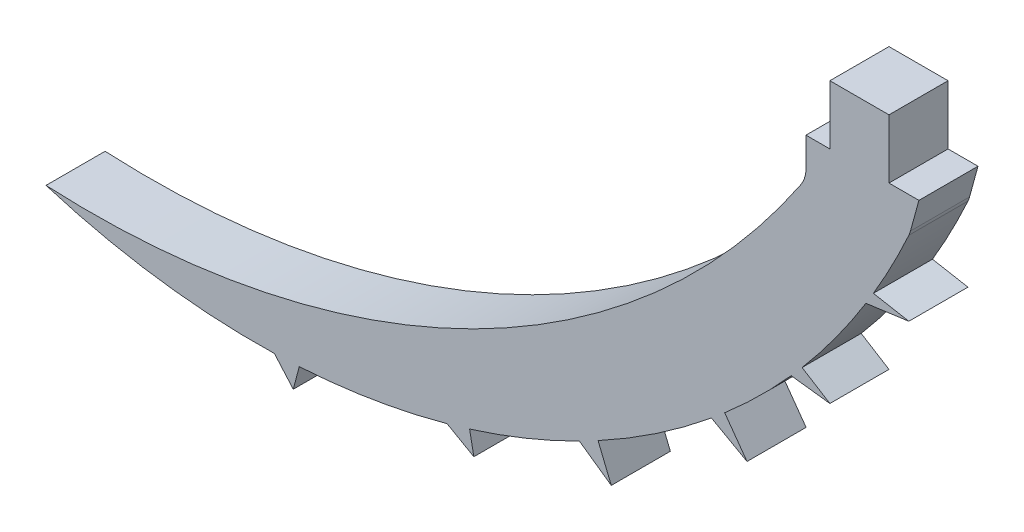
ISO-10303-21;
HEADER;
FILE_DESCRIPTION(('STEP AP214'),'2;1');
FILE_NAME('part.step','',(''),(''),'','','');
FILE_SCHEMA(('AUTOMOTIVE_DESIGN { 1 0 10303 214 1 1 1 1 }'));
ENDSEC;
DATA;
#1=APPLICATION_CONTEXT('core data for automotive mechanical design processes');
#2=APPLICATION_PROTOCOL_DEFINITION('international standard','automotive_design',2000,#1);
#3=PRODUCT_CONTEXT('',#1,'mechanical');
#4=PRODUCT('Part','Part','',(#3));
#5=PRODUCT_RELATED_PRODUCT_CATEGORY('part','',(#4));
#6=PRODUCT_DEFINITION_FORMATION('','',#4);
#7=PRODUCT_DEFINITION_CONTEXT('part definition',#1,'design');
#8=PRODUCT_DEFINITION('design','',#6,#7);
#9=PRODUCT_DEFINITION_SHAPE('','',#8);
#10=(LENGTH_UNIT() NAMED_UNIT(*) SI_UNIT(.MILLI.,.METRE.));
#11=(NAMED_UNIT(*) PLANE_ANGLE_UNIT() SI_UNIT($,.RADIAN.));
#12=(NAMED_UNIT(*) SI_UNIT($,.STERADIAN.) SOLID_ANGLE_UNIT());
#13=UNCERTAINTY_MEASURE_WITH_UNIT(LENGTH_MEASURE(1.E-05),#10,'distance_accuracy_value','');
#14=(GEOMETRIC_REPRESENTATION_CONTEXT(3) GLOBAL_UNCERTAINTY_ASSIGNED_CONTEXT((#13)) GLOBAL_UNIT_ASSIGNED_CONTEXT((#10,
#11,#12)) REPRESENTATION_CONTEXT('',''));
#15=CARTESIAN_POINT('',(0.,0.,0.));
#16=DIRECTION('',(0.,0.,1.));
#17=DIRECTION('',(1.,0.,0.));
#18=AXIS2_PLACEMENT_3D('',#15,#16,#17);
#19=CARTESIAN_POINT('',(-4.33765289990568,0.,1.524));
#20=DIRECTION('',(0.,-1.,0.));
#21=DIRECTION('',(1.,0.,0.));
#22=AXIS2_PLACEMENT_3D('',#19,#20,#21);
#23=PLANE('',#22);
#24=DIRECTION('',(-1.,0.,0.));
#25=VECTOR('',#24,1.);
#26=CARTESIAN_POINT('',(-4.33765289990568,0.,0.));
#27=LINE('',#26,#25);
#28=CARTESIAN_POINT('',(-3.56575185502095,0.,0.));
#29=VERTEX_POINT('',#28);
#30=CARTESIAN_POINT('',(-4.33765289990568,0.,0.));
#31=VERTEX_POINT('',#30);
#32=EDGE_CURVE('E254',#29,#31,#27,.T.);
#33=ORIENTED_EDGE('',*,*,#32,.T.);
#34=DIRECTION('',(0.,0.,-1.));
#35=VECTOR('',#34,1.);
#36=CARTESIAN_POINT('',(-4.33765289990568,0.,1.524));
#37=LINE('',#36,#35);
#38=CARTESIAN_POINT('',(-4.33765289990568,0.,1.524));
#39=VERTEX_POINT('',#38);
#40=EDGE_CURVE('E11',#39,#31,#37,.T.);
#41=ORIENTED_EDGE('',*,*,#40,.F.);
#42=DIRECTION('',(-1.,0.,0.));
#43=VECTOR('',#42,1.);
#44=CARTESIAN_POINT('',(-4.33765289990568,0.,1.524));
#45=LINE('',#44,#43);
#46=CARTESIAN_POINT('',(-3.56575185502095,0.,1.524));
#47=VERTEX_POINT('',#46);
#48=EDGE_CURVE('E310',#47,#39,#45,.T.);
#49=ORIENTED_EDGE('',*,*,#48,.F.);
#50=DIRECTION('',(0.,0.,-1.));
#51=VECTOR('',#50,1.);
#52=CARTESIAN_POINT('',(-3.56575185502095,0.,1.524));
#53=LINE('',#52,#51);
#54=EDGE_CURVE('E250',#47,#29,#53,.T.);
#55=ORIENTED_EDGE('',*,*,#54,.T.);
#56=EDGE_LOOP('',(#33,#41,#49,#55));
#57=FACE_BOUND('',#56,.T.);
#58=ADVANCED_FACE('F32',(#57),#23,.F.);
#59=CARTESIAN_POINT('',(-4.33765289990568,0.,1.524));
#60=DIRECTION('',(-1.,0.,0.));
#61=DIRECTION('',(0.,-1.,0.));
#62=AXIS2_PLACEMENT_3D('',#59,#60,#61);
#63=PLANE('',#62);
#64=DIRECTION('',(0.,1.,0.));
#65=VECTOR('',#64,1.);
#66=CARTESIAN_POINT('',(-4.33765289990568,0.,0.));
#67=LINE('',#66,#65);
#68=CARTESIAN_POINT('',(-4.33765289990569,1.52399999999999,0.));
#69=VERTEX_POINT('',#68);
#70=EDGE_CURVE('E257',#31,#69,#67,.T.);
#71=ORIENTED_EDGE('',*,*,#70,.T.);
#72=DIRECTION('',(0.,0.,-1.));
#73=VECTOR('',#72,1.);
#74=CARTESIAN_POINT('',(-4.33765289990569,1.52399999999999,1.524));
#75=LINE('',#74,#73);
#76=CARTESIAN_POINT('',(-4.33765289990569,1.52399999999999,1.524));
#77=VERTEX_POINT('',#76);
#78=EDGE_CURVE('E40',#77,#69,#75,.T.);
#79=ORIENTED_EDGE('',*,*,#78,.F.);
#80=DIRECTION('',(0.,1.,0.));
#81=VECTOR('',#80,1.);
#82=CARTESIAN_POINT('',(-4.33765289990568,0.,1.524));
#83=LINE('',#82,#81);
#84=EDGE_CURVE('E154',#39,#77,#83,.T.);
#85=ORIENTED_EDGE('',*,*,#84,.F.);
#86=ORIENTED_EDGE('',*,*,#40,.T.);
#87=EDGE_LOOP('',(#71,#79,#85,#86));
#88=FACE_BOUND('',#87,.T.);
#89=ADVANCED_FACE('F473',(#88),#63,.F.);
#90=CARTESIAN_POINT('',(-4.33765289990569,1.52399999999999,1.524));
#91=DIRECTION('',(0.,-1.,0.));
#92=DIRECTION('',(1.,0.,0.));
#93=AXIS2_PLACEMENT_3D('',#90,#91,#92);
#94=PLANE('',#93);
#95=DIRECTION('',(-1.,0.,0.));
#96=VECTOR('',#95,1.);
#97=CARTESIAN_POINT('',(-4.33765289990569,1.52399999999999,0.));
#98=LINE('',#97,#96);
#99=CARTESIAN_POINT('',(-5.86165289990569,1.52399999999999,0.));
#100=VERTEX_POINT('',#99);
#101=EDGE_CURVE('E259',#69,#100,#98,.T.);
#102=ORIENTED_EDGE('',*,*,#101,.T.);
#103=DIRECTION('',(0.,0.,-1.));
#104=VECTOR('',#103,1.);
#105=CARTESIAN_POINT('',(-5.86165289990569,1.52399999999999,1.524));
#106=LINE('',#105,#104);
#107=CARTESIAN_POINT('',(-5.86165289990569,1.52399999999999,1.524));
#108=VERTEX_POINT('',#107);
#109=EDGE_CURVE('E380',#108,#100,#106,.T.);
#110=ORIENTED_EDGE('',*,*,#109,.F.);
#111=DIRECTION('',(-1.,0.,0.));
#112=VECTOR('',#111,1.);
#113=CARTESIAN_POINT('',(-4.33765289990569,1.52399999999999,1.524));
#114=LINE('',#113,#112);
#115=EDGE_CURVE('E388',#77,#108,#114,.T.);
#116=ORIENTED_EDGE('',*,*,#115,.F.);
#117=ORIENTED_EDGE('',*,*,#78,.T.);
#118=EDGE_LOOP('',(#102,#110,#116,#117));
#119=FACE_BOUND('',#118,.T.);
#120=ADVANCED_FACE('F386',(#119),#94,.F.);
#121=CARTESIAN_POINT('',(-5.86165289990569,1.52399999999999,1.524));
#122=DIRECTION('',(1.,0.,0.));
#123=DIRECTION('',(0.,0.,-1.));
#124=AXIS2_PLACEMENT_3D('',#121,#122,#123);
#125=PLANE('',#124);
#126=DIRECTION('',(0.,-1.,0.));
#127=VECTOR('',#126,1.);
#128=CARTESIAN_POINT('',(-5.86165289990569,1.52399999999999,0.));
#129=LINE('',#128,#127);
#130=CARTESIAN_POINT('',(-5.86165289990569,0.,0.));
#131=VERTEX_POINT('',#130);
#132=EDGE_CURVE('E261',#100,#131,#129,.T.);
#133=ORIENTED_EDGE('',*,*,#132,.T.);
#134=DIRECTION('',(0.,0.,-1.));
#135=VECTOR('',#134,1.);
#136=CARTESIAN_POINT('',(-5.86165289990569,0.,1.524));
#137=LINE('',#136,#135);
#138=CARTESIAN_POINT('',(-5.86165289990569,0.,1.524));
#139=VERTEX_POINT('',#138);
#140=EDGE_CURVE('E377',#139,#131,#137,.T.);
#141=ORIENTED_EDGE('',*,*,#140,.F.);
#142=DIRECTION('',(0.,-1.,0.));
#143=VECTOR('',#142,1.);
#144=CARTESIAN_POINT('',(-5.86165289990569,1.52399999999999,1.524));
#145=LINE('',#144,#143);
#146=EDGE_CURVE('E406',#108,#139,#145,.T.);
#147=ORIENTED_EDGE('',*,*,#146,.F.);
#148=ORIENTED_EDGE('',*,*,#109,.T.);
#149=EDGE_LOOP('',(#133,#141,#147,#148));
#150=FACE_BOUND('',#149,.T.);
#151=ADVANCED_FACE('F397',(#150),#125,.F.);
#152=CARTESIAN_POINT('',(-5.86165289990569,0.,1.524));
#153=DIRECTION('',(0.,-1.,0.));
#154=DIRECTION('',(1.,0.,0.));
#155=AXIS2_PLACEMENT_3D('',#152,#153,#154);
#156=PLANE('',#155);
#157=DIRECTION('',(-1.,0.,0.));
#158=VECTOR('',#157,1.);
#159=CARTESIAN_POINT('',(-5.86165289990569,0.,0.));
#160=LINE('',#159,#158);
#161=CARTESIAN_POINT('',(-6.47829093911412,0.,0.));
#162=VERTEX_POINT('',#161);
#163=EDGE_CURVE('E263',#131,#162,#160,.T.);
#164=ORIENTED_EDGE('',*,*,#163,.T.);
#165=DIRECTION('',(0.,0.,-1.));
#166=VECTOR('',#165,1.);
#167=CARTESIAN_POINT('',(-6.47829093911412,0.,1.524));
#168=LINE('',#167,#166);
#169=CARTESIAN_POINT('',(-6.47829093911412,0.,1.524));
#170=VERTEX_POINT('',#169);
#171=EDGE_CURVE('E374',#170,#162,#168,.T.);
#172=ORIENTED_EDGE('',*,*,#171,.F.);
#173=DIRECTION('',(-1.,0.,0.));
#174=VECTOR('',#173,1.);
#175=CARTESIAN_POINT('',(-5.86165289990569,0.,1.524));
#176=LINE('',#175,#174);
#177=EDGE_CURVE('E403',#139,#170,#176,.T.);
#178=ORIENTED_EDGE('',*,*,#177,.F.);
#179=ORIENTED_EDGE('',*,*,#140,.T.);
#180=EDGE_LOOP('',(#164,#172,#178,#179));
#181=FACE_BOUND('',#180,.T.);
#182=ADVANCED_FACE('F401',(#181),#156,.F.);
#183=CARTESIAN_POINT('',(-6.47829093911412,0.,1.524));
#184=DIRECTION('',(1.,0.,0.));
#185=DIRECTION('',(0.,0.,-1.));
#186=AXIS2_PLACEMENT_3D('',#183,#184,#185);
#187=PLANE('',#186);
#188=DIRECTION('',(0.,-1.,0.));
#189=VECTOR('',#188,1.);
#190=CARTESIAN_POINT('',(-6.47829093911412,0.,0.));
#191=LINE('',#190,#189);
#192=CARTESIAN_POINT('',(-6.47829093911412,-0.743115039398693,0.));
#193=VERTEX_POINT('',#192);
#194=EDGE_CURVE('E265',#162,#193,#191,.T.);
#195=ORIENTED_EDGE('',*,*,#194,.T.);
#196=DIRECTION('',(0.,0.,-1.));
#197=VECTOR('',#196,1.);
#198=CARTESIAN_POINT('',(-6.47829093911412,-0.743115039398693,1.524));
#199=LINE('',#198,#197);
#200=CARTESIAN_POINT('',(-6.47829093911412,-0.743115039398693,1.524));
#201=VERTEX_POINT('',#200);
#202=EDGE_CURVE('E371',#201,#193,#199,.T.);
#203=ORIENTED_EDGE('',*,*,#202,.F.);
#204=DIRECTION('',(0.,-1.,0.));
#205=VECTOR('',#204,1.);
#206=CARTESIAN_POINT('',(-6.47829093911412,0.,1.524));
#207=LINE('',#206,#205);
#208=EDGE_CURVE('E405',#170,#201,#207,.T.);
#209=ORIENTED_EDGE('',*,*,#208,.F.);
#210=ORIENTED_EDGE('',*,*,#171,.T.);
#211=EDGE_LOOP('',(#195,#203,#209,#210));
#212=FACE_BOUND('',#211,.T.);
#213=ADVANCED_FACE('F486',(#212),#187,.F.);
#214=CARTESIAN_POINT('',(-7.24029093911412,-0.743115039398693,1.524));
#215=DIRECTION('',(0.,0.,-1.));
#216=DIRECTION('',(-1.,0.,0.));
#217=AXIS2_PLACEMENT_3D('',#214,#215,#216);
#218=CYLINDRICAL_SURFACE('',#217,0.761999999999998);
#219=CARTESIAN_POINT('',(-7.24029093911412,-0.743115039398693,0.));
#220=DIRECTION('',(0.,0.,-1.));
#221=DIRECTION('',(-1.,0.,0.));
#222=AXIS2_PLACEMENT_3D('',#219,#220,#221);
#223=CIRCLE('',#222,0.761999999999998);
#224=CARTESIAN_POINT('',(-6.60705880989039,-1.16697948768232,0.));
#225=VERTEX_POINT('',#224);
#226=EDGE_CURVE('E267',#193,#225,#223,.T.);
#227=ORIENTED_EDGE('',*,*,#226,.T.);
#228=DIRECTION('',(0.,0.,-1.));
#229=VECTOR('',#228,1.);
#230=CARTESIAN_POINT('',(-6.60705880989039,-1.16697948768232,1.524));
#231=LINE('',#230,#229);
#232=CARTESIAN_POINT('',(-6.60705880989039,-1.16697948768232,1.524));
#233=VERTEX_POINT('',#232);
#234=EDGE_CURVE('E368',#233,#225,#231,.T.);
#235=ORIENTED_EDGE('',*,*,#234,.F.);
#236=CARTESIAN_POINT('',(-7.24029093911412,-0.743115039398693,1.524));
#237=DIRECTION('',(0.,0.,-1.));
#238=DIRECTION('',(-1.,0.,0.));
#239=AXIS2_PLACEMENT_3D('',#236,#237,#238);
#240=CIRCLE('',#239,0.761999999999998);
#241=EDGE_CURVE('E408',#201,#233,#240,.T.);
#242=ORIENTED_EDGE('',*,*,#241,.F.);
#243=ORIENTED_EDGE('',*,*,#202,.T.);
#244=EDGE_LOOP('',(#227,#235,#242,#243));
#245=FACE_BOUND('',#244,.T.);
#246=ADVANCED_FACE('F489',(#245),#218,.F.);
#247=CARTESIAN_POINT('',(-24.9319012415506,11.0990583027592,1.524));
#248=DIRECTION('',(0.,0.,-1.));
#249=DIRECTION('',(-1.,0.,0.));
#250=AXIS2_PLACEMENT_3D('',#247,#248,#249);
#251=CYLINDRICAL_SURFACE('',#250,22.0512025345946);
#252=CARTESIAN_POINT('',(-24.9319012415506,11.0990583027592,0.));
#253=DIRECTION('',(0.,0.,-1.));
#254=DIRECTION('',(-1.,0.,0.));
#255=AXIS2_PLACEMENT_3D('',#252,#253,#254);
#256=CIRCLE('',#255,22.0512025345946);
#257=CARTESIAN_POINT('',(-26.0781048515151,-10.9223347164442,0.));
#258=VERTEX_POINT('',#257);
#259=EDGE_CURVE('E269',#225,#258,#256,.T.);
#260=ORIENTED_EDGE('',*,*,#259,.T.);
#261=DIRECTION('',(0.,0.,-1.));
#262=VECTOR('',#261,1.);
#263=CARTESIAN_POINT('',(-26.0781048515151,-10.9223347164442,1.524));
#264=LINE('',#263,#262);
#265=CARTESIAN_POINT('',(-26.0781048515151,-10.9223347164442,1.524));
#266=VERTEX_POINT('',#265);
#267=EDGE_CURVE('E365',#266,#258,#264,.T.);
#268=ORIENTED_EDGE('',*,*,#267,.F.);
#269=CARTESIAN_POINT('',(-24.9319012415506,11.0990583027592,1.524));
#270=DIRECTION('',(0.,0.,-1.));
#271=DIRECTION('',(-1.,0.,0.));
#272=AXIS2_PLACEMENT_3D('',#269,#270,#271);
#273=CIRCLE('',#272,22.0512025345946);
#274=EDGE_CURVE('E414',#233,#266,#273,.T.);
#275=ORIENTED_EDGE('',*,*,#274,.F.);
#276=ORIENTED_EDGE('',*,*,#234,.T.);
#277=EDGE_LOOP('',(#260,#268,#275,#276));
#278=FACE_BOUND('',#277,.T.);
#279=ADVANCED_FACE('F493',(#278),#251,.F.);
#280=CARTESIAN_POINT('',(-20.6492667547291,6.74679523399195,1.524));
#281=DIRECTION('',(0.,0.,-1.));
#282=DIRECTION('',(-1.,0.,0.));
#283=AXIS2_PLACEMENT_3D('',#280,#281,#282);
#284=CYLINDRICAL_SURFACE('',#283,18.4843294789536);
#285=CARTESIAN_POINT('',(-20.6492667547291,6.74679523399195,0.));
#286=DIRECTION('',(0.,0.,1.));
#287=DIRECTION('',(1.,0.,0.));
#288=AXIS2_PLACEMENT_3D('',#285,#286,#287);
#289=CIRCLE('',#288,18.4843294789536);
#290=CARTESIAN_POINT('',(-20.1874725096793,-11.7317648387451,0.));
#291=VERTEX_POINT('',#290);
#292=EDGE_CURVE('E271',#258,#291,#289,.T.);
#293=ORIENTED_EDGE('',*,*,#292,.T.);
#294=DIRECTION('',(0.,0.,-1.));
#295=VECTOR('',#294,1.);
#296=CARTESIAN_POINT('',(-20.1874725096793,-11.7317648387451,1.524));
#297=LINE('',#296,#295);
#298=CARTESIAN_POINT('',(-20.1874725096793,-11.7317648387451,1.524));
#299=VERTEX_POINT('',#298);
#300=EDGE_CURVE('E362',#299,#291,#297,.T.);
#301=ORIENTED_EDGE('',*,*,#300,.F.);
#302=CARTESIAN_POINT('',(-20.6492667547291,6.74679523399195,1.524));
#303=DIRECTION('',(0.,0.,1.));
#304=DIRECTION('',(1.,0.,0.));
#305=AXIS2_PLACEMENT_3D('',#302,#303,#304);
#306=CIRCLE('',#305,18.4843294789536);
#307=EDGE_CURVE('E416',#266,#299,#306,.T.);
#308=ORIENTED_EDGE('',*,*,#307,.F.);
#309=ORIENTED_EDGE('',*,*,#267,.T.);
#310=EDGE_LOOP('',(#293,#301,#308,#309));
#311=FACE_BOUND('',#310,.T.);
#312=ADVANCED_FACE('F497',(#311),#284,.T.);
#313=CARTESIAN_POINT('',(-20.1874725096793,-11.7317648387451,1.524));
#314=DIRECTION('',(0.752033134526811,0.659125302635074,0.));
#315=DIRECTION('',(-0.659125302635075,0.752033134526812,0.));
#316=AXIS2_PLACEMENT_3D('',#313,#314,#315);
#317=PLANE('',#316);
#318=DIRECTION('',(0.659125302635075,-0.752033134526812,0.));
#319=VECTOR('',#318,1.);
#320=CARTESIAN_POINT('',(-20.1874725096793,-11.7317648387451,0.));
#321=LINE('',#320,#319);
#322=CARTESIAN_POINT('',(-19.7006701782811,-12.2871850019717,0.));
#323=VERTEX_POINT('',#322);
#324=EDGE_CURVE('E273',#291,#323,#321,.T.);
#325=ORIENTED_EDGE('',*,*,#324,.T.);
#326=DIRECTION('',(0.,0.,-1.));
#327=VECTOR('',#326,1.);
#328=CARTESIAN_POINT('',(-19.7006701782811,-12.2871850019717,1.524));
#329=LINE('',#328,#327);
#330=CARTESIAN_POINT('',(-19.7006701782811,-12.2871850019717,1.524));
#331=VERTEX_POINT('',#330);
#332=EDGE_CURVE('E359',#331,#323,#329,.T.);
#333=ORIENTED_EDGE('',*,*,#332,.F.);
#334=DIRECTION('',(0.659125302635075,-0.752033134526812,0.));
#335=VECTOR('',#334,1.);
#336=CARTESIAN_POINT('',(-20.1874725096793,-11.7317648387451,1.524));
#337=LINE('',#336,#335);
#338=EDGE_CURVE('E418',#299,#331,#337,.T.);
#339=ORIENTED_EDGE('',*,*,#338,.F.);
#340=ORIENTED_EDGE('',*,*,#300,.T.);
#341=EDGE_LOOP('',(#325,#333,#339,#340));
#342=FACE_BOUND('',#341,.T.);
#343=ADVANCED_FACE('F501',(#342),#317,.F.);
#344=CARTESIAN_POINT('',(-19.7006701782811,-12.2871850019717,1.524));
#345=DIRECTION('',(-0.96694451764489,0.254986862007616,0.));
#346=DIRECTION('',(-0.254986862007616,-0.96694451764489,0.));
#347=AXIS2_PLACEMENT_3D('',#344,#345,#346);
#348=PLANE('',#347);
#349=DIRECTION('',(0.254986862007616,0.96694451764489,0.));
#350=VECTOR('',#349,1.);
#351=CARTESIAN_POINT('',(-19.7006701782811,-12.2871850019717,0.));
#352=LINE('',#351,#350);
#353=CARTESIAN_POINT('',(-19.5470515814063,-11.7046425961125,0.));
#354=VERTEX_POINT('',#353);
#355=EDGE_CURVE('E275',#323,#354,#352,.T.);
#356=ORIENTED_EDGE('',*,*,#355,.T.);
#357=DIRECTION('',(0.,0.,-1.));
#358=VECTOR('',#357,1.);
#359=CARTESIAN_POINT('',(-19.5470515814063,-11.7046425961125,1.524));
#360=LINE('',#359,#358);
#361=CARTESIAN_POINT('',(-19.5470515814063,-11.7046425961125,1.524));
#362=VERTEX_POINT('',#361);
#363=EDGE_CURVE('E356',#362,#354,#360,.T.);
#364=ORIENTED_EDGE('',*,*,#363,.F.);
#365=DIRECTION('',(0.254986862007616,0.96694451764489,0.));
#366=VECTOR('',#365,1.);
#367=CARTESIAN_POINT('',(-19.7006701782811,-12.2871850019717,1.524));
#368=LINE('',#367,#366);
#369=EDGE_CURVE('E420',#331,#362,#368,.T.);
#370=ORIENTED_EDGE('',*,*,#369,.F.);
#371=ORIENTED_EDGE('',*,*,#332,.T.);
#372=EDGE_LOOP('',(#356,#364,#370,#371));
#373=FACE_BOUND('',#372,.T.);
#374=ADVANCED_FACE('F505',(#373),#348,.F.);
#375=CARTESIAN_POINT('',(-20.6492667547291,6.74679523399195,1.524));
#376=DIRECTION('',(0.,0.,-1.));
#377=DIRECTION('',(-1.,0.,0.));
#378=AXIS2_PLACEMENT_3D('',#375,#376,#377);
#379=CYLINDRICAL_SURFACE('',#378,18.4843294789536);
#380=CARTESIAN_POINT('',(-20.6492667547291,6.74679523399195,0.));
#381=DIRECTION('',(0.,0.,1.));
#382=DIRECTION('',(1.,0.,0.));
#383=AXIS2_PLACEMENT_3D('',#380,#381,#382);
#384=CIRCLE('',#383,18.4843294789536);
#385=CARTESIAN_POINT('',(-15.7356363555453,-11.0724828823272,0.));
#386=VERTEX_POINT('',#385);
#387=EDGE_CURVE('E277',#354,#386,#384,.T.);
#388=ORIENTED_EDGE('',*,*,#387,.T.);
#389=DIRECTION('',(0.,0.,-1.));
#390=VECTOR('',#389,1.);
#391=CARTESIAN_POINT('',(-15.7356363555453,-11.0724828823272,1.524));
#392=LINE('',#391,#390);
#393=CARTESIAN_POINT('',(-15.7356363555453,-11.0724828823272,1.524));
#394=VERTEX_POINT('',#393);
#395=EDGE_CURVE('E353',#394,#386,#392,.T.);
#396=ORIENTED_EDGE('',*,*,#395,.F.);
#397=CARTESIAN_POINT('',(-20.6492667547291,6.74679523399195,1.524));
#398=DIRECTION('',(0.,0.,1.));
#399=DIRECTION('',(1.,0.,0.));
#400=AXIS2_PLACEMENT_3D('',#397,#398,#399);
#401=CIRCLE('',#400,18.4843294789536);
#402=EDGE_CURVE('E422',#362,#394,#401,.T.);
#403=ORIENTED_EDGE('',*,*,#402,.F.);
#404=ORIENTED_EDGE('',*,*,#363,.T.);
#405=EDGE_LOOP('',(#388,#396,#403,#404));
#406=FACE_BOUND('',#405,.T.);
#407=ADVANCED_FACE('F509',(#406),#379,.T.);
#408=CARTESIAN_POINT('',(-15.7356363555453,-11.0724828823272,1.524));
#409=DIRECTION('',(0.494588195027553,0.869127445970605,0.));
#410=DIRECTION('',(-0.869127445970605,0.494588195027553,0.));
#411=AXIS2_PLACEMENT_3D('',#408,#409,#410);
#412=PLANE('',#411);
#413=DIRECTION('',(0.869127445970605,-0.494588195027553,0.));
#414=VECTOR('',#413,1.);
#415=CARTESIAN_POINT('',(-15.7356363555453,-11.0724828823272,0.));
#416=LINE('',#415,#414);
#417=CARTESIAN_POINT('',(-15.0437827440442,-11.4661911129463,0.));
#418=VERTEX_POINT('',#417);
#419=EDGE_CURVE('E279',#386,#418,#416,.T.);
#420=ORIENTED_EDGE('',*,*,#419,.T.);
#421=DIRECTION('',(0.,0.,-1.));
#422=VECTOR('',#421,1.);
#423=CARTESIAN_POINT('',(-15.0437827440442,-11.4661911129463,1.524));
#424=LINE('',#423,#422);
#425=CARTESIAN_POINT('',(-15.0437827440442,-11.4661911129463,1.524));
#426=VERTEX_POINT('',#425);
#427=EDGE_CURVE('E350',#426,#418,#424,.T.);
#428=ORIENTED_EDGE('',*,*,#427,.F.);
#429=DIRECTION('',(0.869127445970605,-0.494588195027553,0.));
#430=VECTOR('',#429,1.);
#431=CARTESIAN_POINT('',(-15.7356363555453,-11.0724828823272,1.524));
#432=LINE('',#431,#430);
#433=EDGE_CURVE('E424',#394,#426,#432,.T.);
#434=ORIENTED_EDGE('',*,*,#433,.F.);
#435=ORIENTED_EDGE('',*,*,#395,.T.);
#436=EDGE_LOOP('',(#420,#428,#434,#435));
#437=FACE_BOUND('',#436,.T.);
#438=ADVANCED_FACE('F513',(#437),#412,.F.);
#439=CARTESIAN_POINT('',(-15.0437827440442,-11.4661911129463,1.524));
#440=DIRECTION('',(-0.981331744624594,-0.192322663750404,0.));
#441=DIRECTION('',(0.192322663750404,-0.981331744624594,0.));
#442=AXIS2_PLACEMENT_3D('',#439,#440,#441);
#443=PLANE('',#442);
#444=DIRECTION('',(-0.192322663750404,0.981331744624594,0.));
#445=VECTOR('',#444,1.);
#446=CARTESIAN_POINT('',(-15.0437827440442,-11.4661911129463,0.));
#447=LINE('',#446,#445);
#448=CARTESIAN_POINT('',(-15.1543725228131,-10.9019036887777,0.));
#449=VERTEX_POINT('',#448);
#450=EDGE_CURVE('E281',#418,#449,#447,.T.);
#451=ORIENTED_EDGE('',*,*,#450,.T.);
#452=DIRECTION('',(0.,0.,-1.));
#453=VECTOR('',#452,1.);
#454=CARTESIAN_POINT('',(-15.1543725228131,-10.9019036887777,1.524));
#455=LINE('',#454,#453);
#456=CARTESIAN_POINT('',(-15.1543725228131,-10.9019036887777,1.524));
#457=VERTEX_POINT('',#456);
#458=EDGE_CURVE('E347',#457,#449,#455,.T.);
#459=ORIENTED_EDGE('',*,*,#458,.F.);
#460=DIRECTION('',(-0.192322663750404,0.981331744624594,0.));
#461=VECTOR('',#460,1.);
#462=CARTESIAN_POINT('',(-15.0437827440442,-11.4661911129463,1.524));
#463=LINE('',#462,#461);
#464=EDGE_CURVE('E426',#426,#457,#463,.T.);
#465=ORIENTED_EDGE('',*,*,#464,.F.);
#466=ORIENTED_EDGE('',*,*,#427,.T.);
#467=EDGE_LOOP('',(#451,#459,#465,#466));
#468=FACE_BOUND('',#467,.T.);
#469=ADVANCED_FACE('F517',(#468),#443,.F.);
#470=CARTESIAN_POINT('',(-20.6492667547291,6.74679523399195,1.524));
#471=DIRECTION('',(0.,0.,-1.));
#472=DIRECTION('',(-1.,0.,0.));
#473=AXIS2_PLACEMENT_3D('',#470,#471,#472);
#474=CYLINDRICAL_SURFACE('',#473,18.4843294789536);
#475=CARTESIAN_POINT('',(-20.6492667547291,6.74679523399195,0.));
#476=DIRECTION('',(0.,0.,1.));
#477=DIRECTION('',(1.,0.,0.));
#478=AXIS2_PLACEMENT_3D('',#475,#476,#477);
#479=CIRCLE('',#478,18.4843294789536);
#480=CARTESIAN_POINT('',(-12.3219819891202,-9.75553080565986,0.));
#481=VERTEX_POINT('',#480);
#482=EDGE_CURVE('E283',#449,#481,#479,.T.);
#483=ORIENTED_EDGE('',*,*,#482,.T.);
#484=DIRECTION('',(0.,0.,-1.));
#485=VECTOR('',#484,1.);
#486=CARTESIAN_POINT('',(-12.3219819891202,-9.75553080565986,1.524));
#487=LINE('',#486,#485);
#488=CARTESIAN_POINT('',(-12.3219819891202,-9.75553080565986,1.524));
#489=VERTEX_POINT('',#488);
#490=EDGE_CURVE('E344',#489,#481,#487,.T.);
#491=ORIENTED_EDGE('',*,*,#490,.F.);
#492=CARTESIAN_POINT('',(-20.6492667547291,6.74679523399195,1.524));
#493=DIRECTION('',(0.,0.,1.));
#494=DIRECTION('',(1.,0.,0.));
#495=AXIS2_PLACEMENT_3D('',#492,#493,#494);
#496=CIRCLE('',#495,18.4843294789536);
#497=EDGE_CURVE('E428',#457,#489,#496,.T.);
#498=ORIENTED_EDGE('',*,*,#497,.F.);
#499=ORIENTED_EDGE('',*,*,#458,.T.);
#500=EDGE_LOOP('',(#483,#491,#498,#499));
#501=FACE_BOUND('',#500,.T.);
#502=ADVANCED_FACE('F521',(#501),#474,.T.);
#503=CARTESIAN_POINT('',(-12.3219819891202,-9.75553080565986,1.524));
#504=DIRECTION('',(0.575411852265118,0.817863803009294,0.));
#505=DIRECTION('',(-0.817863803009295,0.575411852265118,0.));
#506=AXIS2_PLACEMENT_3D('',#503,#504,#505);
#507=PLANE('',#506);
#508=DIRECTION('',(0.817863803009294,-0.575411852265118,0.));
#509=VECTOR('',#508,1.);
#510=CARTESIAN_POINT('',(-12.3219819891202,-9.75553080565986,0.));
#511=LINE('',#510,#509);
#512=CARTESIAN_POINT('',(-11.4996321257195,-10.3340988464122,0.));
#513=VERTEX_POINT('',#512);
#514=EDGE_CURVE('E285',#481,#513,#511,.T.);
#515=ORIENTED_EDGE('',*,*,#514,.T.);
#516=DIRECTION('',(0.,0.,-1.));
#517=VECTOR('',#516,1.);
#518=CARTESIAN_POINT('',(-11.4996321257195,-10.3340988464122,1.524));
#519=LINE('',#518,#517);
#520=CARTESIAN_POINT('',(-11.4996321257195,-10.3340988464122,1.524));
#521=VERTEX_POINT('',#520);
#522=EDGE_CURVE('E341',#521,#513,#519,.T.);
#523=ORIENTED_EDGE('',*,*,#522,.F.);
#524=DIRECTION('',(0.817863803009294,-0.575411852265118,0.));
#525=VECTOR('',#524,1.);
#526=CARTESIAN_POINT('',(-12.3219819891202,-9.75553080565986,1.524));
#527=LINE('',#526,#525);
#528=EDGE_CURVE('E430',#489,#521,#527,.T.);
#529=ORIENTED_EDGE('',*,*,#528,.F.);
#530=ORIENTED_EDGE('',*,*,#490,.T.);
#531=EDGE_LOOP('',(#515,#523,#529,#530));
#532=FACE_BOUND('',#531,.T.);
#533=ADVANCED_FACE('F525',(#532),#507,.F.);
#534=CARTESIAN_POINT('',(-11.4996321257195,-10.3340988464122,1.524));
#535=DIRECTION('',(-0.925247973098386,-0.379362871506067,0.));
#536=DIRECTION('',(0.379362871506067,-0.925247973098386,0.));
#537=AXIS2_PLACEMENT_3D('',#534,#535,#536);
#538=PLANE('',#537);
#539=DIRECTION('',(-0.379362871506067,0.925247973098386,0.));
#540=VECTOR('',#539,1.);
#541=CARTESIAN_POINT('',(-11.4996321257195,-10.3340988464122,0.));
#542=LINE('',#541,#540);
#543=CARTESIAN_POINT('',(-11.8402035273094,-9.50346142065309,0.));
#544=VERTEX_POINT('',#543);
#545=EDGE_CURVE('E287',#513,#544,#542,.T.);
#546=ORIENTED_EDGE('',*,*,#545,.T.);
#547=DIRECTION('',(0.,0.,-1.));
#548=VECTOR('',#547,1.);
#549=CARTESIAN_POINT('',(-11.8402035273094,-9.50346142065309,1.524));
#550=LINE('',#549,#548);
#551=CARTESIAN_POINT('',(-11.8402035273094,-9.50346142065309,1.524));
#552=VERTEX_POINT('',#551);
#553=EDGE_CURVE('E338',#552,#544,#550,.T.);
#554=ORIENTED_EDGE('',*,*,#553,.F.);
#555=DIRECTION('',(-0.379362871506067,0.925247973098386,0.));
#556=VECTOR('',#555,1.);
#557=CARTESIAN_POINT('',(-11.4996321257195,-10.3340988464122,1.524));
#558=LINE('',#557,#556);
#559=EDGE_CURVE('E432',#521,#552,#558,.T.);
#560=ORIENTED_EDGE('',*,*,#559,.F.);
#561=ORIENTED_EDGE('',*,*,#522,.T.);
#562=EDGE_LOOP('',(#546,#554,#560,#561));
#563=FACE_BOUND('',#562,.T.);
#564=ADVANCED_FACE('F529',(#563),#538,.F.);
#565=CARTESIAN_POINT('',(-20.6492667547291,6.74679523399195,1.524));
#566=DIRECTION('',(0.,0.,-1.));
#567=DIRECTION('',(-1.,0.,0.));
#568=AXIS2_PLACEMENT_3D('',#565,#566,#567);
#569=CYLINDRICAL_SURFACE('',#568,18.4843294789536);
#570=CARTESIAN_POINT('',(-20.6492667547291,6.74679523399195,0.));
#571=DIRECTION('',(0.,0.,1.));
#572=DIRECTION('',(1.,0.,0.));
#573=AXIS2_PLACEMENT_3D('',#570,#571,#572);
#574=CIRCLE('',#573,18.4843294789536);
#575=CARTESIAN_POINT('',(-8.9162958505765,-7.53633572699909,0.));
#576=VERTEX_POINT('',#575);
#577=EDGE_CURVE('E289',#544,#576,#574,.T.);
#578=ORIENTED_EDGE('',*,*,#577,.T.);
#579=DIRECTION('',(0.,0.,-1.));
#580=VECTOR('',#579,1.);
#581=CARTESIAN_POINT('',(-8.9162958505765,-7.53633572699909,1.524));
#582=LINE('',#581,#580);
#583=CARTESIAN_POINT('',(-8.9162958505765,-7.53633572699909,1.524));
#584=VERTEX_POINT('',#583);
#585=EDGE_CURVE('E335',#584,#576,#582,.T.);
#586=ORIENTED_EDGE('',*,*,#585,.F.);
#587=CARTESIAN_POINT('',(-20.6492667547291,6.74679523399195,1.524));
#588=DIRECTION('',(0.,0.,1.));
#589=DIRECTION('',(1.,0.,0.));
#590=AXIS2_PLACEMENT_3D('',#587,#588,#589);
#591=CIRCLE('',#590,18.4843294789536);
#592=EDGE_CURVE('E434',#552,#584,#591,.T.);
#593=ORIENTED_EDGE('',*,*,#592,.F.);
#594=ORIENTED_EDGE('',*,*,#553,.T.);
#595=EDGE_LOOP('',(#578,#586,#593,#594));
#596=FACE_BOUND('',#595,.T.);
#597=ADVANCED_FACE('F533',(#596),#569,.T.);
#598=CARTESIAN_POINT('',(-8.9162958505765,-7.53633572699908,1.524));
#599=DIRECTION('',(0.488236061075129,0.872711606812836,0.));
#600=DIRECTION('',(-0.872711606812837,0.488236061075129,0.));
#601=AXIS2_PLACEMENT_3D('',#598,#599,#600);
#602=PLANE('',#601);
#603=DIRECTION('',(0.872711606812836,-0.488236061075129,0.));
#604=VECTOR('',#603,1.);
#605=CARTESIAN_POINT('',(-8.9162958505765,-7.53633572699908,0.));
#606=LINE('',#605,#604);
#607=CARTESIAN_POINT('',(-7.99885749421492,-8.04959404268146,0.));
#608=VERTEX_POINT('',#607);
#609=EDGE_CURVE('E291',#576,#608,#606,.T.);
#610=ORIENTED_EDGE('',*,*,#609,.T.);
#611=DIRECTION('',(0.,0.,-1.));
#612=VECTOR('',#611,1.);
#613=CARTESIAN_POINT('',(-7.99885749421492,-8.04959404268146,1.524));
#614=LINE('',#613,#612);
#615=CARTESIAN_POINT('',(-7.99885749421492,-8.04959404268146,1.524));
#616=VERTEX_POINT('',#615);
#617=EDGE_CURVE('E332',#616,#608,#614,.T.);
#618=ORIENTED_EDGE('',*,*,#617,.F.);
#619=DIRECTION('',(0.872711606812836,-0.488236061075129,0.));
#620=VECTOR('',#619,1.);
#621=CARTESIAN_POINT('',(-8.9162958505765,-7.53633572699908,1.524));
#622=LINE('',#621,#620);
#623=EDGE_CURVE('E436',#584,#616,#622,.T.);
#624=ORIENTED_EDGE('',*,*,#623,.F.);
#625=ORIENTED_EDGE('',*,*,#585,.T.);
#626=EDGE_LOOP('',(#610,#618,#624,#625));
#627=FACE_BOUND('',#626,.T.);
#628=ADVANCED_FACE('F537',(#627),#602,.F.);
#629=CARTESIAN_POINT('',(-7.99885749421492,-8.04959404268146,1.524));
#630=DIRECTION('',(-0.81238018031182,-0.583128152841667,0.));
#631=DIRECTION('',(0.583128152841668,-0.81238018031182,0.));
#632=AXIS2_PLACEMENT_3D('',#629,#630,#631);
#633=PLANE('',#632);
#634=DIRECTION('',(-0.583128152841667,0.81238018031182,0.));
#635=VECTOR('',#634,1.);
#636=CARTESIAN_POINT('',(-7.99885749421492,-8.04959404268146,0.));
#637=LINE('',#636,#635);
#638=CARTESIAN_POINT('',(-8.57408572628376,-7.24821957188753,0.));
#639=VERTEX_POINT('',#638);
#640=EDGE_CURVE('E293',#608,#639,#637,.T.);
#641=ORIENTED_EDGE('',*,*,#640,.T.);
#642=DIRECTION('',(0.,0.,-1.));
#643=VECTOR('',#642,1.);
#644=CARTESIAN_POINT('',(-8.57408572628376,-7.24821957188753,1.524));
#645=LINE('',#644,#643);
#646=CARTESIAN_POINT('',(-8.57408572628376,-7.24821957188753,1.524));
#647=VERTEX_POINT('',#646);
#648=EDGE_CURVE('E329',#647,#639,#645,.T.);
#649=ORIENTED_EDGE('',*,*,#648,.F.);
#650=DIRECTION('',(-0.583128152841667,0.81238018031182,0.));
#651=VECTOR('',#650,1.);
#652=CARTESIAN_POINT('',(-7.99885749421492,-8.04959404268146,1.524));
#653=LINE('',#652,#651);
#654=EDGE_CURVE('E438',#616,#647,#653,.T.);
#655=ORIENTED_EDGE('',*,*,#654,.F.);
#656=ORIENTED_EDGE('',*,*,#617,.T.);
#657=EDGE_LOOP('',(#641,#649,#655,#656));
#658=FACE_BOUND('',#657,.T.);
#659=ADVANCED_FACE('F541',(#658),#633,.F.);
#660=CARTESIAN_POINT('',(-20.6492667547291,6.74679523399195,1.524));
#661=DIRECTION('',(0.,0.,-1.));
#662=DIRECTION('',(-1.,0.,0.));
#663=AXIS2_PLACEMENT_3D('',#660,#661,#662);
#664=CYLINDRICAL_SURFACE('',#663,18.4843294789536);
#665=CARTESIAN_POINT('',(-20.6492667547291,6.74679523399195,0.));
#666=DIRECTION('',(0.,0.,1.));
#667=DIRECTION('',(1.,0.,0.));
#668=AXIS2_PLACEMENT_3D('',#665,#666,#667);
#669=CIRCLE('',#668,18.4843294789536);
#670=CARTESIAN_POINT('',(-6.86025742912701,-5.56310558221979,0.));
#671=VERTEX_POINT('',#670);
#672=EDGE_CURVE('E295',#639,#671,#669,.T.);
#673=ORIENTED_EDGE('',*,*,#672,.T.);
#674=DIRECTION('',(0.,0.,-1.));
#675=VECTOR('',#674,1.);
#676=CARTESIAN_POINT('',(-6.86025742912701,-5.56310558221979,1.524));
#677=LINE('',#676,#675);
#678=CARTESIAN_POINT('',(-6.86025742912701,-5.56310558221979,1.524));
#679=VERTEX_POINT('',#678);
#680=EDGE_CURVE('E326',#679,#671,#677,.T.);
#681=ORIENTED_EDGE('',*,*,#680,.F.);
#682=CARTESIAN_POINT('',(-20.6492667547291,6.74679523399195,1.524));
#683=DIRECTION('',(0.,0.,1.));
#684=DIRECTION('',(1.,0.,0.));
#685=AXIS2_PLACEMENT_3D('',#682,#683,#684);
#686=CIRCLE('',#685,18.4843294789536);
#687=EDGE_CURVE('E440',#647,#679,#686,.T.);
#688=ORIENTED_EDGE('',*,*,#687,.F.);
#689=ORIENTED_EDGE('',*,*,#648,.T.);
#690=EDGE_LOOP('',(#673,#681,#688,#689));
#691=FACE_BOUND('',#690,.T.);
#692=ADVANCED_FACE('F545',(#691),#664,.T.);
#693=CARTESIAN_POINT('',(-6.860257429127,-5.56310558221979,1.524));
#694=DIRECTION('',(0.122001079776188,0.992529967574503,0.));
#695=DIRECTION('',(-0.992529967574503,0.122001079776188,0.));
#696=AXIS2_PLACEMENT_3D('',#693,#694,#695);
#697=PLANE('',#696);
#698=DIRECTION('',(0.992529967574503,-0.122001079776188,0.));
#699=VECTOR('',#698,1.);
#700=CARTESIAN_POINT('',(-6.860257429127,-5.56310558221979,0.));
#701=LINE('',#700,#699);
#702=CARTESIAN_POINT('',(-5.86165289990569,-5.68585334280591,0.));
#703=VERTEX_POINT('',#702);
#704=EDGE_CURVE('E297',#671,#703,#701,.T.);
#705=ORIENTED_EDGE('',*,*,#704,.T.);
#706=DIRECTION('',(0.,0.,-1.));
#707=VECTOR('',#706,1.);
#708=CARTESIAN_POINT('',(-5.86165289990569,-5.68585334280591,1.524));
#709=LINE('',#708,#707);
#710=CARTESIAN_POINT('',(-5.86165289990569,-5.68585334280591,1.524));
#711=VERTEX_POINT('',#710);
#712=EDGE_CURVE('E323',#711,#703,#709,.T.);
#713=ORIENTED_EDGE('',*,*,#712,.F.);
#714=DIRECTION('',(0.992529967574503,-0.122001079776188,0.));
#715=VECTOR('',#714,1.);
#716=CARTESIAN_POINT('',(-6.860257429127,-5.56310558221979,1.524));
#717=LINE('',#716,#715);
#718=EDGE_CURVE('E442',#679,#711,#717,.T.);
#719=ORIENTED_EDGE('',*,*,#718,.F.);
#720=ORIENTED_EDGE('',*,*,#680,.T.);
#721=EDGE_LOOP('',(#705,#713,#719,#720));
#722=FACE_BOUND('',#721,.T.);
#723=ADVANCED_FACE('F549',(#722),#697,.F.);
#724=CARTESIAN_POINT('',(-5.86165289990569,-5.68585334280591,1.524));
#725=DIRECTION('',(-0.527468219127415,-0.849574762931759,0.));
#726=DIRECTION('',(0.849574762931759,-0.527468219127415,0.));
#727=AXIS2_PLACEMENT_3D('',#724,#725,#726);
#728=PLANE('',#727);
#729=DIRECTION('',(-0.849574762931759,0.527468219127415,0.));
#730=VECTOR('',#729,1.);
#731=CARTESIAN_POINT('',(-5.86165289990569,-5.68585334280591,0.));
#732=LINE('',#731,#730);
#733=CARTESIAN_POINT('',(-6.57892428132298,-5.2405271929546,0.));
#734=VERTEX_POINT('',#733);
#735=EDGE_CURVE('E299',#703,#734,#732,.T.);
#736=ORIENTED_EDGE('',*,*,#735,.T.);
#737=DIRECTION('',(0.,0.,-1.));
#738=VECTOR('',#737,1.);
#739=CARTESIAN_POINT('',(-6.57892428132298,-5.2405271929546,1.524));
#740=LINE('',#739,#738);
#741=CARTESIAN_POINT('',(-6.57892428132298,-5.2405271929546,1.524));
#742=VERTEX_POINT('',#741);
#743=EDGE_CURVE('E320',#742,#734,#740,.T.);
#744=ORIENTED_EDGE('',*,*,#743,.F.);
#745=DIRECTION('',(-0.849574762931759,0.527468219127415,0.));
#746=VECTOR('',#745,1.);
#747=CARTESIAN_POINT('',(-5.86165289990569,-5.68585334280591,1.524));
#748=LINE('',#747,#746);
#749=EDGE_CURVE('E444',#711,#742,#748,.T.);
#750=ORIENTED_EDGE('',*,*,#749,.F.);
#751=ORIENTED_EDGE('',*,*,#712,.T.);
#752=EDGE_LOOP('',(#736,#744,#750,#751));
#753=FACE_BOUND('',#752,.T.);
#754=ADVANCED_FACE('F553',(#753),#728,.F.);
#755=CARTESIAN_POINT('',(-20.6492667547291,6.74679523399195,1.524));
#756=DIRECTION('',(0.,0.,-1.));
#757=DIRECTION('',(-1.,0.,0.));
#758=AXIS2_PLACEMENT_3D('',#755,#756,#757);
#759=CYLINDRICAL_SURFACE('',#758,18.4843294789536);
#760=CARTESIAN_POINT('',(-20.6492667547291,6.74679523399195,0.));
#761=DIRECTION('',(0.,0.,1.));
#762=DIRECTION('',(1.,0.,0.));
#763=AXIS2_PLACEMENT_3D('',#760,#761,#762);
#764=CIRCLE('',#763,18.4843294789536);
#765=CARTESIAN_POINT('',(-4.93317593862865,-2.98330886342626,0.));
#766=VERTEX_POINT('',#765);
#767=EDGE_CURVE('E301',#734,#766,#764,.T.);
#768=ORIENTED_EDGE('',*,*,#767,.T.);
#769=DIRECTION('',(0.,0.,-1.));
#770=VECTOR('',#769,1.);
#771=CARTESIAN_POINT('',(-4.93317593862865,-2.98330886342626,1.524));
#772=LINE('',#771,#770);
#773=CARTESIAN_POINT('',(-4.93317593862865,-2.98330886342626,1.524));
#774=VERTEX_POINT('',#773);
#775=EDGE_CURVE('E317',#774,#766,#772,.T.);
#776=ORIENTED_EDGE('',*,*,#775,.F.);
#777=CARTESIAN_POINT('',(-20.6492667547291,6.74679523399195,1.524));
#778=DIRECTION('',(0.,0.,1.));
#779=DIRECTION('',(1.,0.,0.));
#780=AXIS2_PLACEMENT_3D('',#777,#778,#779);
#781=CIRCLE('',#780,18.4843294789536);
#782=EDGE_CURVE('E446',#742,#774,#781,.T.);
#783=ORIENTED_EDGE('',*,*,#782,.F.);
#784=ORIENTED_EDGE('',*,*,#743,.T.);
#785=EDGE_LOOP('',(#768,#776,#783,#784));
#786=FACE_BOUND('',#785,.T.);
#787=ADVANCED_FACE('F557',(#786),#759,.T.);
#788=CARTESIAN_POINT('',(-4.93317593862865,-2.98330886342626,1.524));
#789=DIRECTION('',(-0.136609071520116,0.990625035812447,0.));
#790=DIRECTION('',(-0.990625035812447,-0.136609071520116,0.));
#791=AXIS2_PLACEMENT_3D('',#788,#789,#790);
#792=PLANE('',#791);
#793=DIRECTION('',(0.990625035812447,0.136609071520116,0.));
#794=VECTOR('',#793,1.);
#795=CARTESIAN_POINT('',(-4.93317593862865,-2.98330886342626,0.));
#796=LINE('',#795,#794);
#797=CARTESIAN_POINT('',(-3.82490486983271,-2.83047618079912,0.));
#798=VERTEX_POINT('',#797);
#799=EDGE_CURVE('E303',#766,#798,#796,.T.);
#800=ORIENTED_EDGE('',*,*,#799,.T.);
#801=DIRECTION('',(0.,0.,-1.));
#802=VECTOR('',#801,1.);
#803=CARTESIAN_POINT('',(-3.82490486983271,-2.83047618079912,1.524));
#804=LINE('',#803,#802);
#805=CARTESIAN_POINT('',(-3.82490486983271,-2.83047618079912,1.524));
#806=VERTEX_POINT('',#805);
#807=EDGE_CURVE('E314',#806,#798,#804,.T.);
#808=ORIENTED_EDGE('',*,*,#807,.F.);
#809=DIRECTION('',(0.990625035812447,0.136609071520116,0.));
#810=VECTOR('',#809,1.);
#811=CARTESIAN_POINT('',(-4.93317593862865,-2.98330886342626,1.524));
#812=LINE('',#811,#810);
#813=EDGE_CURVE('E448',#774,#806,#812,.T.);
#814=ORIENTED_EDGE('',*,*,#813,.F.);
#815=ORIENTED_EDGE('',*,*,#775,.T.);
#816=EDGE_LOOP('',(#800,#808,#814,#815));
#817=FACE_BOUND('',#816,.T.);
#818=ADVANCED_FACE('F454',(#817),#792,.F.);
#819=CARTESIAN_POINT('',(-3.82490486983271,-2.83047618079912,1.524));
#820=DIRECTION('',(-0.17917398964234,-0.983817402486684,0.));
#821=DIRECTION('',(0.983817402486684,-0.17917398964234,0.));
#822=AXIS2_PLACEMENT_3D('',#819,#820,#821);
#823=PLANE('',#822);
#824=DIRECTION('',(-0.983817402486684,0.17917398964234,0.));
#825=VECTOR('',#824,1.);
#826=CARTESIAN_POINT('',(-3.82490486983271,-2.83047618079912,0.));
#827=LINE('',#826,#825);
#828=CARTESIAN_POINT('',(-4.73982901295585,-2.66384911308399,0.));
#829=VERTEX_POINT('',#828);
#830=EDGE_CURVE('E305',#798,#829,#827,.T.);
#831=ORIENTED_EDGE('',*,*,#830,.T.);
#832=DIRECTION('',(0.,0.,-1.));
#833=VECTOR('',#832,1.);
#834=CARTESIAN_POINT('',(-4.73982901295585,-2.66384911308399,1.524));
#835=LINE('',#834,#833);
#836=CARTESIAN_POINT('',(-4.73982901295585,-2.66384911308399,1.524));
#837=VERTEX_POINT('',#836);
#838=EDGE_CURVE('E245',#837,#829,#835,.T.);
#839=ORIENTED_EDGE('',*,*,#838,.F.);
#840=DIRECTION('',(-0.983817402486684,0.17917398964234,0.));
#841=VECTOR('',#840,1.);
#842=CARTESIAN_POINT('',(-3.82490486983271,-2.83047618079912,1.524));
#843=LINE('',#842,#841);
#844=EDGE_CURVE('E236',#806,#837,#843,.T.);
#845=ORIENTED_EDGE('',*,*,#844,.F.);
#846=ORIENTED_EDGE('',*,*,#807,.T.);
#847=EDGE_LOOP('',(#831,#839,#845,#846));
#848=FACE_BOUND('',#847,.T.);
#849=ADVANCED_FACE('F458',(#848),#823,.F.);
#850=CARTESIAN_POINT('',(-20.6492667547291,6.74679523399195,1.524));
#851=DIRECTION('',(0.,0.,-1.));
#852=DIRECTION('',(-1.,0.,0.));
#853=AXIS2_PLACEMENT_3D('',#850,#851,#852);
#854=CYLINDRICAL_SURFACE('',#853,18.4843294789536);
#855=CARTESIAN_POINT('',(-20.6492667547291,6.74679523399195,0.));
#856=DIRECTION('',(0.,0.,1.));
#857=DIRECTION('',(1.,0.,0.));
#858=AXIS2_PLACEMENT_3D('',#855,#856,#857);
#859=CIRCLE('',#858,18.4843294789536);
#860=CARTESIAN_POINT('',(-3.82490486983271,-0.90900540686575,0.));
#861=VERTEX_POINT('',#860);
#862=EDGE_CURVE('E244',#829,#861,#859,.T.);
#863=ORIENTED_EDGE('',*,*,#862,.T.);
#864=DIRECTION('',(0.,0.,-1.));
#865=VECTOR('',#864,1.);
#866=CARTESIAN_POINT('',(-3.82490486983271,-0.90900540686575,1.524));
#867=LINE('',#866,#865);
#868=CARTESIAN_POINT('',(-3.82490486983271,-0.90900540686575,1.524));
#869=VERTEX_POINT('',#868);
#870=EDGE_CURVE('E241',#869,#861,#867,.T.);
#871=ORIENTED_EDGE('',*,*,#870,.F.);
#872=CARTESIAN_POINT('',(-20.6492667547291,6.74679523399195,1.524));
#873=DIRECTION('',(0.,0.,1.));
#874=DIRECTION('',(1.,0.,0.));
#875=AXIS2_PLACEMENT_3D('',#872,#873,#874);
#876=CIRCLE('',#875,18.4843294789536);
#877=EDGE_CURVE('E230',#837,#869,#876,.T.);
#878=ORIENTED_EDGE('',*,*,#877,.F.);
#879=ORIENTED_EDGE('',*,*,#838,.T.);
#880=EDGE_LOOP('',(#863,#871,#878,#879));
#881=FACE_BOUND('',#880,.T.);
#882=ADVANCED_FACE('F242',(#881),#854,.T.);
#883=CARTESIAN_POINT('',(-4.51847418598714,-0.593401852245275,1.524));
#884=DIRECTION('',(0.,0.,-1.));
#885=DIRECTION('',(-1.,0.,0.));
#886=AXIS2_PLACEMENT_3D('',#883,#884,#885);
#887=CYLINDRICAL_SURFACE('',#886,0.762000000000002);
#888=CARTESIAN_POINT('',(-4.51847418598714,-0.593401852245275,0.));
#889=DIRECTION('',(0.,0.,1.));
#890=DIRECTION('',(-1.,0.,0.));
#891=AXIS2_PLACEMENT_3D('',#888,#889,#890);
#892=CIRCLE('',#891,0.762000000000002);
#893=CARTESIAN_POINT('',(-3.78357244483239,-0.794805503770562,0.));
#894=VERTEX_POINT('',#893);
#895=EDGE_CURVE('E140',#861,#894,#892,.T.);
#896=ORIENTED_EDGE('',*,*,#895,.T.);
#897=DIRECTION('',(0.,0.,-1.));
#898=VECTOR('',#897,1.);
#899=CARTESIAN_POINT('',(-3.78357244483239,-0.794805503770562,1.524));
#900=LINE('',#899,#898);
#901=CARTESIAN_POINT('',(-3.78357244483239,-0.794805503770562,1.524));
#902=VERTEX_POINT('',#901);
#903=EDGE_CURVE('E246',#902,#894,#900,.T.);
#904=ORIENTED_EDGE('',*,*,#903,.F.);
#905=CARTESIAN_POINT('',(-4.51847418598714,-0.593401852245275,1.524));
#906=DIRECTION('',(0.,0.,1.));
#907=DIRECTION('',(-1.,0.,0.));
#908=AXIS2_PLACEMENT_3D('',#905,#906,#907);
#909=CIRCLE('',#908,0.762000000000002);
#910=EDGE_CURVE('E234',#869,#902,#909,.T.);
#911=ORIENTED_EDGE('',*,*,#910,.F.);
#912=ORIENTED_EDGE('',*,*,#870,.T.);
#913=EDGE_LOOP('',(#896,#904,#911,#912));
#914=FACE_BOUND('',#913,.T.);
#915=ADVANCED_FACE('F248',(#914),#887,.T.);
#916=CARTESIAN_POINT('',(-3.56575185502095,0.,1.524));
#917=DIRECTION('',(-0.964437980518043,0.264309253970192,0.));
#918=DIRECTION('',(-0.264309253970192,-0.964437980518043,0.));
#919=AXIS2_PLACEMENT_3D('',#916,#917,#918);
#920=PLANE('',#919);
#921=DIRECTION('',(0.264309253970192,0.964437980518043,0.));
#922=VECTOR('',#921,1.);
#923=CARTESIAN_POINT('',(-3.56575185502095,0.,0.));
#924=LINE('',#923,#922);
#925=EDGE_CURVE('E146',#894,#29,#924,.T.);
#926=ORIENTED_EDGE('',*,*,#925,.T.);
#927=ORIENTED_EDGE('',*,*,#54,.F.);
#928=DIRECTION('',(0.264309253970192,0.964437980518043,0.));
#929=VECTOR('',#928,1.);
#930=CARTESIAN_POINT('',(-3.56575185502095,0.,1.524));
#931=LINE('',#930,#929);
#932=EDGE_CURVE('E48',#902,#47,#931,.T.);
#933=ORIENTED_EDGE('',*,*,#932,.F.);
#934=ORIENTED_EDGE('',*,*,#903,.T.);
#935=EDGE_LOOP('',(#926,#927,#933,#934));
#936=FACE_BOUND('',#935,.T.);
#937=ADVANCED_FACE('F462',(#936),#920,.F.);
#938=CARTESIAN_POINT('',(-4.51847418598714,-0.593401852245275,1.524));
#939=DIRECTION('',(0.,0.,-1.));
#940=DIRECTION('',(-1.,0.,0.));
#941=AXIS2_PLACEMENT_3D('',#938,#939,#940);
#942=PLANE('',#941);
#943=ORIENTED_EDGE('',*,*,#48,.T.);
#944=ORIENTED_EDGE('',*,*,#84,.T.);
#945=ORIENTED_EDGE('',*,*,#115,.T.);
#946=ORIENTED_EDGE('',*,*,#146,.T.);
#947=ORIENTED_EDGE('',*,*,#177,.T.);
#948=ORIENTED_EDGE('',*,*,#208,.T.);
#949=ORIENTED_EDGE('',*,*,#241,.T.);
#950=ORIENTED_EDGE('',*,*,#274,.T.);
#951=ORIENTED_EDGE('',*,*,#307,.T.);
#952=ORIENTED_EDGE('',*,*,#338,.T.);
#953=ORIENTED_EDGE('',*,*,#369,.T.);
#954=ORIENTED_EDGE('',*,*,#402,.T.);
#955=ORIENTED_EDGE('',*,*,#433,.T.);
#956=ORIENTED_EDGE('',*,*,#464,.T.);
#957=ORIENTED_EDGE('',*,*,#497,.T.);
#958=ORIENTED_EDGE('',*,*,#528,.T.);
#959=ORIENTED_EDGE('',*,*,#559,.T.);
#960=ORIENTED_EDGE('',*,*,#592,.T.);
#961=ORIENTED_EDGE('',*,*,#623,.T.);
#962=ORIENTED_EDGE('',*,*,#654,.T.);
#963=ORIENTED_EDGE('',*,*,#687,.T.);
#964=ORIENTED_EDGE('',*,*,#718,.T.);
#965=ORIENTED_EDGE('',*,*,#749,.T.);
#966=ORIENTED_EDGE('',*,*,#782,.T.);
#967=ORIENTED_EDGE('',*,*,#813,.T.);
#968=ORIENTED_EDGE('',*,*,#844,.T.);
#969=ORIENTED_EDGE('',*,*,#877,.T.);
#970=ORIENTED_EDGE('',*,*,#910,.T.);
#971=ORIENTED_EDGE('',*,*,#932,.T.);
#972=EDGE_LOOP('',(#943,#944,#945,#946,#947,#948,#949,#950,#951,#952,#953,#954,#955,#956,#957,
#958,#959,#960,#961,#962,#963,#964,#965,#966,#967,#968,#969,#970,#971));
#973=FACE_BOUND('',#972,.T.);
#974=ADVANCED_FACE('F232',(#973),#942,.F.);
#975=CARTESIAN_POINT('',(-4.51847418598714,-0.593401852245275,0.));
#976=DIRECTION('',(0.,0.,-1.));
#977=DIRECTION('',(-1.,0.,0.));
#978=AXIS2_PLACEMENT_3D('',#975,#976,#977);
#979=PLANE('',#978);
#980=ORIENTED_EDGE('',*,*,#32,.F.);
#981=ORIENTED_EDGE('',*,*,#925,.F.);
#982=ORIENTED_EDGE('',*,*,#895,.F.);
#983=ORIENTED_EDGE('',*,*,#862,.F.);
#984=ORIENTED_EDGE('',*,*,#830,.F.);
#985=ORIENTED_EDGE('',*,*,#799,.F.);
#986=ORIENTED_EDGE('',*,*,#767,.F.);
#987=ORIENTED_EDGE('',*,*,#735,.F.);
#988=ORIENTED_EDGE('',*,*,#704,.F.);
#989=ORIENTED_EDGE('',*,*,#672,.F.);
#990=ORIENTED_EDGE('',*,*,#640,.F.);
#991=ORIENTED_EDGE('',*,*,#609,.F.);
#992=ORIENTED_EDGE('',*,*,#577,.F.);
#993=ORIENTED_EDGE('',*,*,#545,.F.);
#994=ORIENTED_EDGE('',*,*,#514,.F.);
#995=ORIENTED_EDGE('',*,*,#482,.F.);
#996=ORIENTED_EDGE('',*,*,#450,.F.);
#997=ORIENTED_EDGE('',*,*,#419,.F.);
#998=ORIENTED_EDGE('',*,*,#387,.F.);
#999=ORIENTED_EDGE('',*,*,#355,.F.);
#1000=ORIENTED_EDGE('',*,*,#324,.F.);
#1001=ORIENTED_EDGE('',*,*,#292,.F.);
#1002=ORIENTED_EDGE('',*,*,#259,.F.);
#1003=ORIENTED_EDGE('',*,*,#226,.F.);
#1004=ORIENTED_EDGE('',*,*,#194,.F.);
#1005=ORIENTED_EDGE('',*,*,#163,.F.);
#1006=ORIENTED_EDGE('',*,*,#132,.F.);
#1007=ORIENTED_EDGE('',*,*,#101,.F.);
#1008=ORIENTED_EDGE('',*,*,#70,.F.);
#1009=EDGE_LOOP('',(#980,#981,#982,#983,#984,#985,#986,#987,#988,#989,#990,#991,#992,#993,#994,
#995,#996,#997,#998,#999,#1000,#1001,#1002,#1003,#1004,#1005,#1006,#1007,#1008));
#1010=FACE_BOUND('',#1009,.T.);
#1011=ADVANCED_FACE('F392',(#1010),#979,.T.);
#1012=CLOSED_SHELL('',(#58,#89,#120,#151,#182,#213,#246,#279,#312,#343,#374,#407,#438,#469,#502,
#533,#564,#597,#628,#659,#692,#723,#754,#787,#818,#849,#882,#915,#937,#974,#1011));
#1013=MANIFOLD_SOLID_BREP('B2',#1012);
#1014=ADVANCED_BREP_SHAPE_REPRESENTATION('',(#18,#1013),#14);
#1015=SHAPE_DEFINITION_REPRESENTATION(#9,#1014);
ENDSEC;
END-ISO-10303-21;
